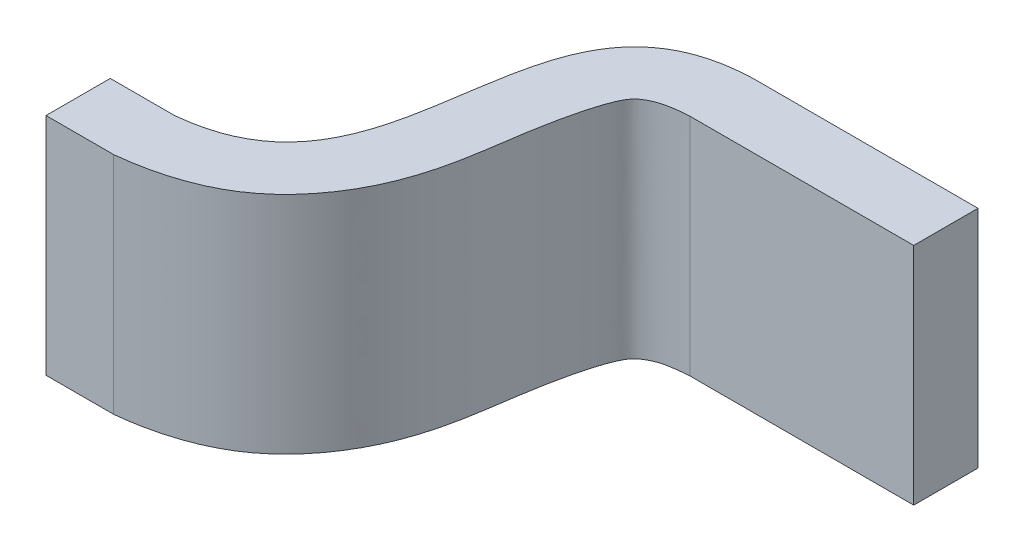
ISO-10303-21;
HEADER;
FILE_DESCRIPTION(('STEP AP214'),'2;1');
FILE_NAME('part.step','',(''),(''),'','','');
FILE_SCHEMA(('AUTOMOTIVE_DESIGN { 1 0 10303 214 1 1 1 1 }'));
ENDSEC;
DATA;
#1=APPLICATION_CONTEXT('core data for automotive mechanical design processes');
#2=APPLICATION_PROTOCOL_DEFINITION('international standard','automotive_design',2000,#1);
#3=PRODUCT_CONTEXT('',#1,'mechanical');
#4=PRODUCT('Part','Part','',(#3));
#5=PRODUCT_RELATED_PRODUCT_CATEGORY('part','',(#4));
#6=PRODUCT_DEFINITION_FORMATION('','',#4);
#7=PRODUCT_DEFINITION_CONTEXT('part definition',#1,'design');
#8=PRODUCT_DEFINITION('design','',#6,#7);
#9=PRODUCT_DEFINITION_SHAPE('','',#8);
#10=(LENGTH_UNIT() NAMED_UNIT(*) SI_UNIT(.MILLI.,.METRE.));
#11=(NAMED_UNIT(*) PLANE_ANGLE_UNIT() SI_UNIT($,.RADIAN.));
#12=(NAMED_UNIT(*) SI_UNIT($,.STERADIAN.) SOLID_ANGLE_UNIT());
#13=UNCERTAINTY_MEASURE_WITH_UNIT(LENGTH_MEASURE(1.E-05),#10,'distance_accuracy_value','');
#14=(GEOMETRIC_REPRESENTATION_CONTEXT(3) GLOBAL_UNCERTAINTY_ASSIGNED_CONTEXT((#13)) GLOBAL_UNIT_ASSIGNED_CONTEXT((#10,
#11,#12)) REPRESENTATION_CONTEXT('',''));
#15=CARTESIAN_POINT('',(0.,0.,0.));
#16=DIRECTION('',(0.,0.,1.));
#17=DIRECTION('',(1.,0.,0.));
#18=AXIS2_PLACEMENT_3D('',#15,#16,#17);
#19=CARTESIAN_POINT('',(0.381062000989914,2.52312396585783,1.20000011583518));
#20=DIRECTION('',(0.,1.,4.37113882867379E-08));
#21=DIRECTION('',(-1.,0.,0.));
#22=AXIS2_PLACEMENT_3D('',#19,#20,#21);
#23=PLANE('',#22);
#24=DIRECTION('',(1.,0.,0.));
#25=VECTOR('',#24,1.);
#26=CARTESIAN_POINT('',(8.21956578272591,2.52312400956922,0.200000115835179));
#27=LINE('',#26,#25);
#28=CARTESIAN_POINT('',(8.21956578272591,2.52312400956922,0.200000115835179));
#29=VERTEX_POINT('',#28);
#30=CARTESIAN_POINT('',(8.91606200098991,2.52312400956922,0.200000115835179));
#31=VERTEX_POINT('',#30);
#32=EDGE_CURVE('E11',#29,#31,#27,.T.);
#33=ORIENTED_EDGE('',*,*,#32,.F.);
#34=CARTESIAN_POINT('',(8.21956578272591,2.52312400956922,0.200000115835179));
#35=CARTESIAN_POINT('',(8.21399807265752,2.52312400955949,0.200222776944905));
#36=CARTESIAN_POINT('',(8.20843683975348,2.52312400954419,0.200572641902588));
#37=CARTESIAN_POINT('',(8.19732835868844,2.52312400950362,0.201500774403512));
#38=CARTESIAN_POINT('',(8.19178112714533,2.52312400947834,0.202079242715004));
#39=CARTESIAN_POINT('',(8.18066889231238,2.52312400941871,0.203443322434662));
#40=CARTESIAN_POINT('',(8.17510408096633,2.5231240093843,0.204230494227507));
#41=CARTESIAN_POINT('',(8.16401243640824,2.52312400930556,0.206032025455519));
#42=CARTESIAN_POINT('',(8.15848559635561,2.52312400926123,0.207046342801843));
#43=CARTESIAN_POINT('',(8.1465743503038,2.5231240091484,0.209627439938685));
#44=CARTESIAN_POINT('',(8.14020246940725,2.52312400907708,0.211258532996007));
#45=CARTESIAN_POINT('',(8.12921644404484,2.52312400891854,0.214886282236412));
#46=CARTESIAN_POINT('',(8.12454576276441,2.52312400883918,0.216702760571251));
#47=CARTESIAN_POINT('',(8.11575076349414,2.52312400866246,0.220743140574118));
#48=CARTESIAN_POINT('',(8.11161057174428,2.52312400856656,0.222934029282875));
#49=CARTESIAN_POINT('',(8.10253183379761,2.52312400834097,0.228105288870864));
#50=CARTESIAN_POINT('',(8.09762635625911,2.52312400820857,0.231151795559119));
#51=CARTESIAN_POINT('',(8.09022405842899,2.52312400795017,0.237031494419057));
#52=CARTESIAN_POINT('',(8.08749164440591,2.52312400783869,0.239554186113194));
#53=CARTESIAN_POINT('',(8.08246087272025,2.52312400760365,0.245002831356049));
#54=CARTESIAN_POINT('',(8.08016330387861,2.52312400748007,0.247929501418368));
#55=CARTESIAN_POINT('',(8.0759951087917,2.52312400721485,0.253960636256993));
#56=CARTESIAN_POINT('',(8.07411551519148,2.52312400707371,0.25705910373885));
#57=CARTESIAN_POINT('',(8.0706064493533,2.52312400679961,0.263392983262515));
#58=CARTESIAN_POINT('',(8.06897710136162,2.52312400666664,0.266628462319741));
#59=CARTESIAN_POINT('',(8.06367328775614,2.52312400620033,0.277849961425244));
#60=CARTESIAN_POINT('',(8.06040085858409,2.52312400585197,0.286022147622745));
#61=CARTESIAN_POINT('',(8.05218527798451,2.52312400487333,0.308422259036946));
#62=CARTESIAN_POINT('',(8.04771455008864,2.52312400421915,0.322813352311754));
#63=CARTESIAN_POINT('',(8.03961753260656,2.52312400294465,0.351470017552813));
#64=CARTESIAN_POINT('',(8.03597437543715,2.5231240023239,0.365731021163681));
#65=CARTESIAN_POINT('',(8.02919339350917,2.52312400107437,0.394362236027059));
#66=CARTESIAN_POINT('',(8.02605527280588,2.52312400044561,0.408732378117502));
#67=CARTESIAN_POINT('',(8.01736410075411,2.52312399859094,0.451139639563148));
#68=CARTESIAN_POINT('',(8.01232518312452,2.52312399736121,0.47928285266773));
#69=CARTESIAN_POINT('',(8.00335647907099,2.52312399489062,0.535811291131599));
#70=CARTESIAN_POINT('',(7.99942969347175,2.52312399364972,0.564196962317594));
#71=CARTESIAN_POINT('',(7.99170167000416,2.52312399139707,0.615729883457315));
#72=CARTESIAN_POINT('',(7.98800715437185,2.52312399038463,0.638892226484105));
#73=CARTESIAN_POINT('',(7.9794355355205,2.52312398836895,0.685005925928551));
#74=CARTESIAN_POINT('',(7.97455858675596,2.52312398736571,0.707957309496564));
#75=CARTESIAN_POINT('',(7.96311271686074,2.52312398538232,0.753331714529177));
#76=CARTESIAN_POINT('',(7.95655194608926,2.52312398440209,0.775756728489748));
#77=CARTESIAN_POINT('',(7.94136784202336,2.52312398247281,0.819893767638995));
#78=CARTESIAN_POINT('',(7.93274558328642,2.52312398152374,0.841606157601739));
#79=CARTESIAN_POINT('',(7.91043792110496,2.52312397940145,0.89015849210333));
#80=CARTESIAN_POINT('',(7.89600936729224,2.5231239782429,0.916662758440508));
#81=CARTESIAN_POINT('',(7.86347434987592,2.52312397602451,0.967413518681063));
#82=CARTESIAN_POINT('',(7.8453597746674,2.5231239749649,0.991654858034514));
#83=CARTESIAN_POINT('',(7.80790002602411,2.52312397310642,1.03417172187135));
#84=CARTESIAN_POINT('',(7.78897432705133,2.52312397229153,1.05281426512947));
#85=CARTESIAN_POINT('',(7.74844565833539,2.52312397080478,1.0868270722472));
#86=CARTESIAN_POINT('',(7.72685155874366,2.52312397013248,1.10220773934811));
#87=CARTESIAN_POINT('',(7.68359472899701,2.52312396901348,1.12780737627416));
#88=CARTESIAN_POINT('',(7.66213857495581,2.5231239685513,1.13838063101694));
#89=CARTESIAN_POINT('',(7.61806563506122,2.5231239677407,1.15692500960786));
#90=CARTESIAN_POINT('',(7.59544469766516,2.52312396739273,1.16488595544565));
#91=CARTESIAN_POINT('',(7.54848495398505,2.52312396678386,1.17881519350099));
#92=CARTESIAN_POINT('',(7.52411482818412,2.52312396652766,1.18467623918143));
#93=CARTESIAN_POINT('',(7.47514110847119,2.52312396611884,1.19402877138319));
#94=CARTESIAN_POINT('',(7.45054141254349,2.52312396596534,1.19754050603348));
#95=CARTESIAN_POINT('',(7.42586117783791,2.52312396585784,1.20000011583518));
#96=B_SPLINE_CURVE_WITH_KNOTS('',3,(#34,#35,#36,#37,#38,#39,#40,#41,#42,#43,#44,#45,#46,#47,#48,
#49,#50,#51,#52,#53,#54,#55,#56,#57,#58,#59,#60,#61,#62,#63,#64,#65,#66,#67,#68,#69,#70,#71,#72,
#73,#74,#75,#76,#77,#78,#79,#80,#81,#82,#83,#84,#85,#86,#87,#88,#89,#90,#91,#92,#93,#94,#95),
.UNSPECIFIED.,.F.,.F.,(4,2,2,2,2,2,2,2,2,2,2,2,2,2,2,2,2,2,2,2,2,2,2,2,2,2,2,2,2,2,4),(0.,
0.0167129049826591,0.0334405206169283,0.0502969119078462,0.0671501823813333,0.0868449977925691,
0.101838970321101,0.115885127156847,0.133132127804882,0.144236213112223,0.155360252414285,
0.166215762863006,0.177076645740437,0.203446553112075,0.248618617741089,0.29276509657911,
0.336885611219411,0.422622380023035,0.50858833183353,0.578941414817065,0.649285312924711,
0.719294937731856,0.789268149044618,0.87950221806083,0.969937050040229,1.04934324822106,
1.12849225200604,1.200024637838,1.27183250557101,1.34691026454656,1.42133231106535),.UNSPECIFIED.);
#97=CARTESIAN_POINT('',(7.42586117783791,2.52312396585783,1.20000011583518));
#98=VERTEX_POINT('',#97);
#99=EDGE_CURVE('E144',#29,#98,#96,.T.);
#100=ORIENTED_EDGE('',*,*,#99,.T.);
#101=DIRECTION('',(1.,0.,0.));
#102=VECTOR('',#101,1.);
#103=CARTESIAN_POINT('',(7.21606200098991,2.52312396585783,1.20000011583518));
#104=LINE('',#103,#102);
#105=CARTESIAN_POINT('',(7.21606200098991,2.52312396585783,1.20000011583518));
#106=VERTEX_POINT('',#105);
#107=EDGE_CURVE('E153',#106,#98,#104,.T.);
#108=ORIENTED_EDGE('',*,*,#107,.F.);
#109=DIRECTION('',(0.,4.37113878426487E-08,-0.999999999999999));
#110=VECTOR('',#109,1.);
#111=CARTESIAN_POINT('',(7.21606200098991,2.52312396585783,1.20000011583518));
#112=LINE('',#111,#110);
#113=CARTESIAN_POINT('',(7.21606200098991,2.52312397460011,1.00000011583518));
#114=VERTEX_POINT('',#113);
#115=EDGE_CURVE('E176',#106,#114,#112,.T.);
#116=ORIENTED_EDGE('',*,*,#115,.T.);
#117=DIRECTION('',(-1.,0.,0.));
#118=VECTOR('',#117,1.);
#119=CARTESIAN_POINT('',(7.41606200098991,2.52312397460011,1.00000011583518));
#120=LINE('',#119,#118);
#121=CARTESIAN_POINT('',(7.41606200098991,2.52312397460011,1.00000011583518));
#122=VERTEX_POINT('',#121);
#123=EDGE_CURVE('E166',#122,#114,#120,.T.);
#124=ORIENTED_EDGE('',*,*,#123,.F.);
#125=CARTESIAN_POINT('',(8.21606200098991,2.5231240183115,1.15835178985639E-07));
#126=CARTESIAN_POINT('',(8.19358510313693,2.52312401827862,0.000752060468581158));
#127=CARTESIAN_POINT('',(8.17100793476501,2.52312401820095,0.00252901377854064));
#128=CARTESIAN_POINT('',(8.12597309478915,2.5231240179187,0.00898640023387658));
#129=CARTESIAN_POINT('',(8.10352138339691,2.52312401771237,0.0137066074111825));
#130=CARTESIAN_POINT('',(8.06515365819845,2.52312401720618,0.0252870083113087));
#131=CARTESIAN_POINT('',(8.04899929251523,2.52312401694226,0.0313245870723057));
#132=CARTESIAN_POINT('',(8.01789140683102,2.52312401630879,0.0458166204881442));
#133=CARTESIAN_POINT('',(8.00293202850773,2.5231240159398,0.0542582222089987));
#134=CARTESIAN_POINT('',(7.97580927414815,2.52312401512717,0.0728490012215347));
#135=CARTESIAN_POINT('',(7.96351851659414,2.52312401469169,0.0828115771405194));
#136=CARTESIAN_POINT('',(7.94069381725784,2.52312401373943,0.104596721389228));
#137=CARTESIAN_POINT('',(7.93016206041085,2.52312401322255,0.116421568042133));
#138=CARTESIAN_POINT('',(7.90934268339576,2.52312401203432,0.143605165307551));
#139=CARTESIAN_POINT('',(7.89939730340264,2.52312401135162,0.159223393880874));
#140=CARTESIAN_POINT('',(7.8817786902267,2.52312400993181,0.191705024628724));
#141=CARTESIAN_POINT('',(7.87411125124448,2.52312400919456,0.208571468087363));
#142=CARTESIAN_POINT('',(7.85831224281672,2.52312400743597,0.248803432527052));
#143=CARTESIAN_POINT('',(7.85089650929936,2.52312400640268,0.272442120704842));
#144=CARTESIAN_POINT('',(7.83819654268846,2.52312400431375,0.320231127397665));
#145=CARTESIAN_POINT('',(7.83291120075709,2.52312400325813,0.34438117285117));
#146=CARTESIAN_POINT('',(7.82019523572656,2.52312400038412,0.410131041851886));
#147=CARTESIAN_POINT('',(7.81390954748546,2.52312399855682,0.451934402083061));
#148=CARTESIAN_POINT('',(7.80123041061269,2.52312399489243,0.535765928705813));
#149=CARTESIAN_POINT('',(7.79483655698354,2.52312399305533,0.57779405169264));
#150=CARTESIAN_POINT('',(7.78272745030488,2.52312399036376,0.639369848598376));
#151=CARTESIAN_POINT('',(7.77840818033405,2.52312398949819,0.659171782886779));
#152=CARTESIAN_POINT('',(7.76846333575577,2.52312398778033,0.698471838212411));
#153=CARTESIAN_POINT('',(7.76283677771603,2.52312398692805,0.717969718676909));
#154=CARTESIAN_POINT('',(7.74980357127116,2.5231239852589,0.756155364665872));
#155=CARTESIAN_POINT('',(7.74241624835149,2.52312398444175,0.774849489753706));
#156=CARTESIAN_POINT('',(7.72528765923403,2.52312398285693,0.81110604819965));
#157=CARTESIAN_POINT('',(7.71555219177743,2.52312398208914,0.828671136436786));
#158=CARTESIAN_POINT('',(7.69291712212291,2.5231239806087,0.862539616126325));
#159=CARTESIAN_POINT('',(7.67992280719315,2.52312397989875,0.878781377405067));
#160=CARTESIAN_POINT('',(7.6509915949129,2.52312397860445,0.908391476138882));
#161=CARTESIAN_POINT('',(7.63505740825526,2.52312397801999,0.921762436225387));
#162=CARTESIAN_POINT('',(7.60251216289671,2.52312397704608,0.944042929275912));
#163=CARTESIAN_POINT('',(7.58610329850445,2.52312397664351,0.953252501908174));
#164=CARTESIAN_POINT('',(7.55200247896581,2.52312397595383,0.969030528465972));
#165=CARTESIAN_POINT('',(7.53430550805647,2.52312397566721,0.975587925812751));
#166=CARTESIAN_POINT('',(7.49987529020758,2.52312397521736,0.985879214749981));
#167=CARTESIAN_POINT('',(7.48319962545166,2.52312397504532,0.989814821998697));
#168=CARTESIAN_POINT('',(7.44971156339336,2.52312397477337,0.996036316685443));
#169=CARTESIAN_POINT('',(7.43290223265527,2.52312397467274,0.998338413303283));
#170=CARTESIAN_POINT('',(7.41606200098991,2.52312397460011,1.00000011583518));
#171=B_SPLINE_CURVE_WITH_KNOTS('',3,(#125,#126,#127,#128,#129,#130,#131,#132,#133,#134,#135,
#136,#137,#138,#139,#140,#141,#142,#143,#144,#145,#146,#147,#148,#149,#150,#151,#152,#153,#154,
#155,#156,#157,#158,#159,#160,#161,#162,#163,#164,#165,#166,#167,#168,#169,#170),.UNSPECIFIED.,
.F.,.F.,(4,2,2,2,2,2,2,2,2,2,2,2,2,2,2,2,2,2,2,2,2,2,4),(0.,0.0676605368254322,
0.136255841823736,0.187815232472042,0.239103979458815,0.286357475935161,0.333669238509404,
0.388978971846571,0.44442821035716,0.518581097757562,0.592695339665635,0.719482422739692,
0.846974988060579,0.907746805484855,0.968564488536605,1.02874313069962,1.08877465652057,
1.15080863583323,1.21278570033354,1.2689745883637,1.32539536427915,1.3767136749948,
1.42751535438906),.UNSPECIFIED.);
#172=CARTESIAN_POINT('',(8.21606200098991,2.5231240183115,1.15835178959856E-07));
#173=VERTEX_POINT('',#172);
#174=EDGE_CURVE('E99',#173,#122,#171,.T.);
#175=ORIENTED_EDGE('',*,*,#174,.F.);
#176=DIRECTION('',(1.,0.,0.));
#177=VECTOR('',#176,1.);
#178=CARTESIAN_POINT('',(8.21606200098991,2.5231240183115,1.15835178959856E-07));
#179=LINE('',#178,#177);
#180=CARTESIAN_POINT('',(8.91606200098991,2.5231240183115,1.15835178959856E-07));
#181=VERTEX_POINT('',#180);
#182=EDGE_CURVE('E93',#173,#181,#179,.T.);
#183=ORIENTED_EDGE('',*,*,#182,.T.);
#184=DIRECTION('',(0.,4.37113878426487E-08,-0.999999999999999));
#185=VECTOR('',#184,1.);
#186=CARTESIAN_POINT('',(8.91606200098991,2.52312400956922,0.200000115835179));
#187=LINE('',#186,#185);
#188=EDGE_CURVE('E145',#31,#181,#187,.T.);
#189=ORIENTED_EDGE('',*,*,#188,.F.);
#190=EDGE_LOOP('',(#33,#100,#108,#116,#124,#175,#183,#189));
#191=FACE_BOUND('',#190,.T.);
#192=ADVANCED_FACE('F17',(#191),#23,.F.);
#193=CARTESIAN_POINT('',(8.91606200098991,-0.126876034142165,1.2));
#194=DIRECTION('',(-1.,0.,0.));
#195=DIRECTION('',(0.,-1.,-4.37113882867379E-08));
#196=AXIS2_PLACEMENT_3D('',#193,#194,#195);
#197=PLANE('',#196);
#198=DIRECTION('',(0.,-0.999999999999999,-4.37113883184585E-08));
#199=VECTOR('',#198,1.);
#200=CARTESIAN_POINT('',(8.91606200098991,3.22312400956922,0.200000146433151));
#201=LINE('',#200,#199);
#202=CARTESIAN_POINT('',(8.91606200098991,3.22312400956922,0.200000146433151));
#203=VERTEX_POINT('',#202);
#204=EDGE_CURVE('E25',#203,#31,#201,.T.);
#205=ORIENTED_EDGE('',*,*,#204,.T.);
#206=ORIENTED_EDGE('',*,*,#188,.T.);
#207=DIRECTION('',(0.,0.999999999999999,4.37113882867379E-08));
#208=VECTOR('',#207,1.);
#209=CARTESIAN_POINT('',(8.91606200098992,2.5231240183115,1.15835178959856E-07));
#210=LINE('',#209,#208);
#211=CARTESIAN_POINT('',(8.91606200098991,3.2231240183115,1.46433150760572E-07));
#212=VERTEX_POINT('',#211);
#213=EDGE_CURVE('E178',#181,#212,#210,.T.);
#214=ORIENTED_EDGE('',*,*,#213,.T.);
#215=DIRECTION('',(0.,4.37113856222026E-08,-0.999999999999999));
#216=VECTOR('',#215,1.);
#217=CARTESIAN_POINT('',(8.91606200098991,3.22312400956922,0.200000146433151));
#218=LINE('',#217,#216);
#219=EDGE_CURVE('E168',#203,#212,#218,.T.);
#220=ORIENTED_EDGE('',*,*,#219,.F.);
#221=EDGE_LOOP('',(#205,#206,#214,#220));
#222=FACE_BOUND('',#221,.T.);
#223=ADVANCED_FACE('F129',(#222),#197,.F.);
#224=CARTESIAN_POINT('',(0.381062000989914,3.22312396585783,1.20000014643315));
#225=DIRECTION('',(0.,1.,4.37113882867379E-08));
#226=DIRECTION('',(-1.,0.,0.));
#227=AXIS2_PLACEMENT_3D('',#224,#225,#226);
#228=PLANE('',#227);
#229=CARTESIAN_POINT('',(7.42586117783791,3.22312396585783,1.20000014643315));
#230=CARTESIAN_POINT('',(7.44449456455245,3.22312396593834,1.19815829311156));
#231=CARTESIAN_POINT('',(7.46307138920936,3.22312396604573,1.1957015166836));
#232=CARTESIAN_POINT('',(7.50004861252762,3.22312396631693,1.18949711709641));
#233=CARTESIAN_POINT('',(7.51844854392413,3.22312396648087,1.18574671960165));
#234=CARTESIAN_POINT('',(7.55509153595032,3.22312396686924,1.1768617432686));
#235=CARTESIAN_POINT('',(7.57333169379044,3.22312396709421,1.17171500907457));
#236=CARTESIAN_POINT('',(7.60930812319983,3.22312396760934,1.15993021636413));
#237=CARTESIAN_POINT('',(7.62704477874541,3.22312396789945,1.15329333065393));
#238=CARTESIAN_POINT('',(7.66763102639651,3.22312396866299,1.13582561747603));
#239=CARTESIAN_POINT('',(7.69020930230345,3.22312396916528,1.12433441236623));
#240=CARTESIAN_POINT('',(7.73310469641282,3.22312397032142,1.09788519223995));
#241=CARTESIAN_POINT('',(7.75343190343484,3.22312397097454,1.08294365553175));
#242=CARTESIAN_POINT('',(7.79009677821303,3.22312397234773,1.05152865848007));
#243=CARTESIAN_POINT('',(7.80662324596257,3.22312397305833,1.0352719624628));
#244=CARTESIAN_POINT('',(7.83755765996604,3.22312397456551,1.00079164379411));
#245=CARTESIAN_POINT('',(7.85196002142665,3.22312397536231,0.98256304699255));
#246=CARTESIAN_POINT('',(7.88022177077408,3.22312397712182,0.942310265469555));
#247=CARTESIAN_POINT('',(7.89380605024984,3.22312397809294,0.920093478990381));
#248=CARTESIAN_POINT('',(7.91819190207816,3.22312398009773,0.874229263846631));
#249=CARTESIAN_POINT('',(7.92899719645396,3.22312398113131,0.850583801679557));
#250=CARTESIAN_POINT('',(7.94870311897535,3.2231239833315,0.800249273213149));
#251=CARTESIAN_POINT('',(7.95737164040108,3.22312398450204,0.773470381934672));
#252=CARTESIAN_POINT('',(7.97209186166946,3.2231239868744,0.719197126059222));
#253=CARTESIAN_POINT('',(7.97814037844916,3.22312398807626,0.691701933955639));
#254=CARTESIAN_POINT('',(7.98658106878577,3.22312399004254,0.646718729204653));
#255=CARTESIAN_POINT('',(7.9894956830336,3.22312399080298,0.62932158999021));
#256=CARTESIAN_POINT('',(7.99494513059396,3.2231239923266,0.59446518172622));
#257=CARTESIAN_POINT('',(7.99747987765393,3.22312399308977,0.577005899485013));
#258=CARTESIAN_POINT('',(8.0025677923373,3.22312399461587,0.542092952289064));
#259=CARTESIAN_POINT('',(8.0051209563143,3.22312399537879,0.524639286900343));
#260=CARTESIAN_POINT('',(8.01066424363703,3.22312399690142,0.489805741266521));
#261=CARTESIAN_POINT('',(8.01365424883576,3.22312399766112,0.472425842374471));
#262=CARTESIAN_POINT('',(8.02152943419566,3.22312399951487,0.430017032898861));
#263=CARTESIAN_POINT('',(8.02666524973689,3.22312400060698,0.405032304682354));
#264=CARTESIAN_POINT('',(8.03548182293312,3.22312400223388,0.36781302785188));
#265=CARTESIAN_POINT('',(8.03860689712085,3.22312400277441,0.355447107207849));
#266=CARTESIAN_POINT('',(8.04536938827822,3.22312400384923,0.330858216277031));
#267=CARTESIAN_POINT('',(8.0490065173587,3.22312400438353,0.318635169816701));
#268=CARTESIAN_POINT('',(8.05548047715351,3.22312400522547,0.29937351408224));
#269=CARTESIAN_POINT('',(8.05804302673184,3.22312400553709,0.292244100310987));
#270=CARTESIAN_POINT('',(8.0636211387904,3.22312400615223,0.278172012219551));
#271=CARTESIAN_POINT('',(8.06663601514539,3.22312400645575,0.271229073529859));
#272=CARTESIAN_POINT('',(8.07290394389426,3.22312400699022,0.25900006127776));
#273=CARTESIAN_POINT('',(8.07601005444361,3.22312400722422,0.25364488459391));
#274=CARTESIAN_POINT('',(8.08294021652617,3.22312400763222,0.244316143597421));
#275=CARTESIAN_POINT('',(8.08663640359496,3.22312400781004,0.240254122817685));
#276=CARTESIAN_POINT('',(8.09608537337927,3.22312400816656,0.232076112648614));
#277=CARTESIAN_POINT('',(8.10212282018808,3.22312400832975,0.228304198420808));
#278=CARTESIAN_POINT('',(8.1113394806663,3.22312400855853,0.223113238150879));
#279=CARTESIAN_POINT('',(8.11442600625127,3.22312400863187,0.221466306758503));
#280=CARTESIAN_POINT('',(8.12071629067352,3.22312400876321,0.218417518195715));
#281=CARTESIAN_POINT('',(8.12391972716149,3.22312400882125,0.217015040865018));
#282=CARTESIAN_POINT('',(8.13303992233348,3.22312400897159,0.213465188849452));
#283=CARTESIAN_POINT('',(8.13907333321131,3.22312400905404,0.211621845714587));
#284=CARTESIAN_POINT('',(8.14884209661085,3.22312400916708,0.20913735378251));
#285=CARTESIAN_POINT('',(8.15253527613093,3.22312400920524,0.208309839512022));
#286=CARTESIAN_POINT('',(8.15995085696976,3.22312400927275,0.206799804590628));
#287=CARTESIAN_POINT('',(8.16367325397941,3.2231240093021,0.206117262960337));
#288=CARTESIAN_POINT('',(8.17603608060719,3.22312400939235,0.204032222659835));
#289=CARTESIAN_POINT('',(8.18471588454658,3.22312400944403,0.202861256763462));
#290=CARTESIAN_POINT('',(8.19776684921997,3.22312400950474,0.201476741708385));
#291=CARTESIAN_POINT('',(8.20211947594062,3.22312400952216,0.201077367887049));
#292=CARTESIAN_POINT('',(8.21083512156969,3.22312400955065,0.200424137179815));
#293=CARTESIAN_POINT('',(8.2151981395132,3.22312400956172,0.200170267274331));
#294=CARTESIAN_POINT('',(8.21956578272591,3.22312400956922,0.200000146433151));
#295=B_SPLINE_CURVE_WITH_KNOTS('',3,(#229,#230,#231,#232,#233,#234,#235,#236,#237,#238,#239,
#240,#241,#242,#243,#244,#245,#246,#247,#248,#249,#250,#251,#252,#253,#254,#255,#256,#257,#258,
#259,#260,#261,#262,#263,#264,#265,#266,#267,#268,#269,#270,#271,#272,#273,#274,#275,#276,#277,
#278,#279,#280,#281,#282,#283,#284,#285,#286,#287,#288,#289,#290,#291,#292,#293,#294),
.UNSPECIFIED.,.F.,.F.,(4,2,2,2,2,2,2,2,2,2,2,2,2,2,2,2,2,2,2,2,2,2,2,2,2,2,2,2,2,2,2,2,4),(0.,
0.0561681589095705,0.112457534383138,0.16925357861237,0.226005077906886,0.301715004036544,
0.377070566346,0.446424912055152,0.515958475234817,0.593880428548584,0.671697467408244,
0.755964517163008,0.840333658382208,0.893247792631839,0.946173923407371,0.999089848164162,
1.05199148781442,1.12847716172405,1.16673541076623,1.20497223539784,1.22769072756634,
1.25037510056687,1.26886797593494,1.28517999290265,1.30634908955326,1.31685139211729,
1.32732665061524,1.34619861049414,1.35755137220421,1.36890248990409,1.39515927363249,
1.40827024085607,1.42138003473644),.UNSPECIFIED.);
#296=CARTESIAN_POINT('',(7.42586117783791,3.22312396585783,1.20000014643315));
#297=VERTEX_POINT('',#296);
#298=CARTESIAN_POINT('',(8.21956578272591,3.22312400956922,0.200000146433151));
#299=VERTEX_POINT('',#298);
#300=EDGE_CURVE('E137',#297,#299,#295,.T.);
#301=ORIENTED_EDGE('',*,*,#300,.T.);
#302=DIRECTION('',(-1.,0.,0.));
#303=VECTOR('',#302,1.);
#304=CARTESIAN_POINT('',(8.91606200098991,3.22312400956922,0.20000014643315));
#305=LINE('',#304,#303);
#306=EDGE_CURVE('E180',#203,#299,#305,.T.);
#307=ORIENTED_EDGE('',*,*,#306,.F.);
#308=ORIENTED_EDGE('',*,*,#219,.T.);
#309=DIRECTION('',(1.,0.,0.));
#310=VECTOR('',#309,1.);
#311=CARTESIAN_POINT('',(8.21606200098991,3.2231240183115,1.46433150760572E-07));
#312=LINE('',#311,#310);
#313=CARTESIAN_POINT('',(8.21606200098991,3.2231240183115,1.46433150760572E-07));
#314=VERTEX_POINT('',#313);
#315=EDGE_CURVE('E89',#314,#212,#312,.T.);
#316=ORIENTED_EDGE('',*,*,#315,.F.);
#317=CARTESIAN_POINT('',(7.41606200098991,3.22312397460011,1.00000014643315));
#318=CARTESIAN_POINT('',(7.43815778445574,3.22312397469533,0.997821656245103));
#319=CARTESIAN_POINT('',(7.46027008731141,3.22312397483942,0.994525285186105));
#320=CARTESIAN_POINT('',(7.50408400428581,3.22312397525691,0.984974292672355));
#321=CARTESIAN_POINT('',(7.52577839318445,3.22312397553172,0.978687426312377));
#322=CARTESIAN_POINT('',(7.56322329112044,3.22312397616423,0.964217354769986));
#323=CARTESIAN_POINT('',(7.5792399824135,3.22312397649087,0.956744450547586));
#324=CARTESIAN_POINT('',(7.60983504569206,3.22312397724919,0.939396203850117));
#325=CARTESIAN_POINT('',(7.62441982579596,3.22312397768036,0.929532321418256));
#326=CARTESIAN_POINT('',(7.65126115653245,3.22312397862777,0.907858113568546));
#327=CARTESIAN_POINT('',(7.6635794953477,3.22312397914066,0.896124373556234));
#328=CARTESIAN_POINT('',(7.68622733401037,3.22312398024537,0.870851495061245));
#329=CARTESIAN_POINT('',(7.69655342153458,3.22312398083732,0.857309325052825));
#330=CARTESIAN_POINT('',(7.72884756758449,3.22312398298411,0.808196686858197));
#331=CARTESIAN_POINT('',(7.74576979626087,3.22312398468164,0.769361701724757));
#332=CARTESIAN_POINT('',(7.76850315318357,3.22312398771057,0.700067913553522));
#333=CARTESIAN_POINT('',(7.77605677562103,3.22312398902294,0.670044164635463));
#334=CARTESIAN_POINT('',(7.78893462477029,3.22312399167122,0.609458584143951));
#335=CARTESIAN_POINT('',(7.79425506876476,3.22312399300716,0.578895930227287));
#336=CARTESIAN_POINT('',(7.80736012985758,3.223123996586,0.497021644491724));
#337=CARTESIAN_POINT('',(7.81438963042532,3.2231239988335,0.445604821645049));
#338=CARTESIAN_POINT('',(7.82796229628551,3.22312400218308,0.368975338703381));
#339=CARTESIAN_POINT('',(7.83298877156952,3.22312400329557,0.343524372231839));
#340=CARTESIAN_POINT('',(7.84502531219308,3.2231240054988,0.293120494476764));
#341=CARTESIAN_POINT('',(7.85203211919115,3.22312400658957,0.268166836549349));
#342=CARTESIAN_POINT('',(7.8696664235696,3.22312400877064,0.218269786618546));
#343=CARTESIAN_POINT('',(7.88043363403057,3.223124009859,0.193370846879312));
#344=CARTESIAN_POINT('',(7.90026910052031,3.22312401139717,0.158181406897513));
#345=CARTESIAN_POINT('',(7.90746633375543,3.22312401189274,0.146844113194546));
#346=CARTESIAN_POINT('',(7.92318388320907,3.22312401284169,0.125134699088058));
#347=CARTESIAN_POINT('',(7.93170293407124,3.22312401329511,0.114761670638015));
#348=CARTESIAN_POINT('',(7.95303839952588,3.22312401428579,0.0920977534487856));
#349=CARTESIAN_POINT('',(7.96635443397192,3.22312401480287,0.0802681917571193));
#350=CARTESIAN_POINT('',(7.99492929472639,3.22312401572307,0.0592163752155682));
#351=CARTESIAN_POINT('',(8.01019136911424,3.223124016126,0.0499985643969283));
#352=CARTESIAN_POINT('',(8.04268080697371,3.22312401683092,0.0338719816870521));
#353=CARTESIAN_POINT('',(8.05996419457089,3.22312401712787,0.0270783020968767));
#354=CARTESIAN_POINT('',(8.09533290547705,3.22312401761224,0.0159972198193967));
#355=CARTESIAN_POINT('',(8.11342000632037,3.22312401779939,0.011715703680814));
#356=CARTESIAN_POINT('',(8.14565822903883,3.22312401805052,0.00597065826712747));
#357=CARTESIAN_POINT('',(8.15973896311656,3.22312401813307,0.00408197404208984));
#358=CARTESIAN_POINT('',(8.18790024228703,3.22312401825332,0.00133098364696402));
#359=CARTESIAN_POINT('',(8.20198005813918,3.22312401829134,0.000461382229156337));
#360=CARTESIAN_POINT('',(8.21606200098995,3.2231240183115,1.46433149535788E-07));
#361=B_SPLINE_CURVE_WITH_KNOTS('',3,(#317,#318,#319,#320,#321,#322,#323,#324,#325,#326,#327,
#328,#329,#330,#331,#332,#333,#334,#335,#336,#337,#338,#339,#340,#341,#342,#343,#344,#345,#346,
#347,#348,#349,#350,#351,#352,#353,#354,#355,#356,#357,#358,#359,#360),.UNSPECIFIED.,.F.,.F.,(4,
2,2,2,2,2,2,2,2,2,2,2,2,2,2,2,2,2,2,2,2,4),(0.,0.0667821137090889,0.134301214684031,
0.187128508823993,0.239707439757742,0.290518731452934,0.34141629467506,0.466712259088976,
0.559563019654512,0.652570428897924,0.808245450373598,0.886023921415198,0.96367515719079,
1.04458784966541,1.08478909463837,1.12495209032638,1.17807587168458,1.2312895104201,
1.28677003517691,1.34238004906255,1.38496468867346,1.42724258099923),.UNSPECIFIED.);
#362=CARTESIAN_POINT('',(7.41606200098991,3.22312397460011,1.00000014643315));
#363=VERTEX_POINT('',#362);
#364=EDGE_CURVE('E81',#363,#314,#361,.T.);
#365=ORIENTED_EDGE('',*,*,#364,.F.);
#366=DIRECTION('',(1.,0.,0.));
#367=VECTOR('',#366,1.);
#368=CARTESIAN_POINT('',(7.21606200098991,3.22312397460011,1.00000014643315));
#369=LINE('',#368,#367);
#370=CARTESIAN_POINT('',(7.21606200098991,3.22312397460011,1.00000014643315));
#371=VERTEX_POINT('',#370);
#372=EDGE_CURVE('E86',#371,#363,#369,.T.);
#373=ORIENTED_EDGE('',*,*,#372,.F.);
#374=DIRECTION('',(0.,4.37113878426487E-08,-0.999999999999999));
#375=VECTOR('',#374,1.);
#376=CARTESIAN_POINT('',(7.21606200098991,3.22312396585783,1.20000014643315));
#377=LINE('',#376,#375);
#378=CARTESIAN_POINT('',(7.21606200098991,3.22312396585783,1.20000014643315));
#379=VERTEX_POINT('',#378);
#380=EDGE_CURVE('E164',#379,#371,#377,.T.);
#381=ORIENTED_EDGE('',*,*,#380,.F.);
#382=DIRECTION('',(1.,0.,0.));
#383=VECTOR('',#382,1.);
#384=CARTESIAN_POINT('',(7.21606200098991,3.22312396585783,1.20000014643315));
#385=LINE('',#384,#383);
#386=EDGE_CURVE('E190',#379,#297,#385,.T.);
#387=ORIENTED_EDGE('',*,*,#386,.T.);
#388=EDGE_LOOP('',(#301,#307,#308,#316,#365,#373,#381,#387));
#389=FACE_BOUND('',#388,.T.);
#390=ADVANCED_FACE('F83',(#389),#228,.T.);
#391=CARTESIAN_POINT('',(7.21606200098991,-0.126876034142165,1.2));
#392=DIRECTION('',(-1.,0.,0.));
#393=DIRECTION('',(0.,-1.,-4.37113882867379E-08));
#394=AXIS2_PLACEMENT_3D('',#391,#392,#393);
#395=PLANE('',#394);
#396=ORIENTED_EDGE('',*,*,#380,.T.);
#397=DIRECTION('',(0.,-0.999999999999999,-4.37113881598552E-08));
#398=VECTOR('',#397,1.);
#399=CARTESIAN_POINT('',(7.21606200098991,3.22312397460011,1.00000014643315));
#400=LINE('',#399,#398);
#401=EDGE_CURVE('E107',#371,#114,#400,.T.);
#402=ORIENTED_EDGE('',*,*,#401,.T.);
#403=ORIENTED_EDGE('',*,*,#115,.F.);
#404=DIRECTION('',(0.,0.999999999999999,4.37113878426487E-08));
#405=VECTOR('',#404,1.);
#406=CARTESIAN_POINT('',(7.21606200098991,2.52312396585783,1.20000011583518));
#407=LINE('',#406,#405);
#408=EDGE_CURVE('E92',#106,#379,#407,.T.);
#409=ORIENTED_EDGE('',*,*,#408,.T.);
#410=EDGE_LOOP('',(#396,#402,#403,#409));
#411=FACE_BOUND('',#410,.T.);
#412=ADVANCED_FACE('F128',(#411),#395,.T.);
#413=CARTESIAN_POINT('',(0.381062000989914,-0.126875981688499,0.));
#414=DIRECTION('',(0.,-4.37113882867379E-08,1.));
#415=DIRECTION('',(0.,-1.,-4.37113882867379E-08));
#416=AXIS2_PLACEMENT_3D('',#413,#414,#415);
#417=PLANE('',#416);
#418=DIRECTION('',(0.,-0.999999999999999,-4.37113882867379E-08));
#419=VECTOR('',#418,1.);
#420=CARTESIAN_POINT('',(8.21606200098991,3.2231240183115,1.46433150760572E-07));
#421=LINE('',#420,#419);
#422=EDGE_CURVE('E174',#314,#173,#421,.T.);
#423=ORIENTED_EDGE('',*,*,#422,.F.);
#424=ORIENTED_EDGE('',*,*,#315,.T.);
#425=ORIENTED_EDGE('',*,*,#213,.F.);
#426=ORIENTED_EDGE('',*,*,#182,.F.);
#427=EDGE_LOOP('',(#423,#424,#425,#426));
#428=FACE_BOUND('',#427,.T.);
#429=ADVANCED_FACE('F227',(#428),#417,.F.);
#430=CARTESIAN_POINT('',(0.381062000989914,-0.126876034142165,1.2));
#431=DIRECTION('',(0.,-4.37113882867379E-08,1.));
#432=DIRECTION('',(0.,-1.,-4.37113882867379E-08));
#433=AXIS2_PLACEMENT_3D('',#430,#431,#432);
#434=PLANE('',#433);
#435=DIRECTION('',(0.,-0.999999999999999,-4.37113887942684E-08));
#436=VECTOR('',#435,1.);
#437=CARTESIAN_POINT('',(7.42586117783791,3.22312396585784,1.20000014643315));
#438=LINE('',#437,#436);
#439=EDGE_CURVE('E161',#297,#98,#438,.T.);
#440=ORIENTED_EDGE('',*,*,#439,.F.);
#441=ORIENTED_EDGE('',*,*,#386,.F.);
#442=ORIENTED_EDGE('',*,*,#408,.F.);
#443=ORIENTED_EDGE('',*,*,#107,.T.);
#444=EDGE_LOOP('',(#440,#441,#442,#443));
#445=FACE_BOUND('',#444,.T.);
#446=ADVANCED_FACE('F160',(#445),#434,.T.);
#447=CARTESIAN_POINT('',(0.381062000989914,5.01775443609411,1.00000022487894));
#448=DIRECTION('',(0.,4.37113882867379E-08,-1.));
#449=DIRECTION('',(0.,1.,4.37113882867379E-08));
#450=AXIS2_PLACEMENT_3D('',#447,#448,#449);
#451=PLANE('',#450);
#452=ORIENTED_EDGE('',*,*,#123,.T.);
#453=ORIENTED_EDGE('',*,*,#401,.F.);
#454=ORIENTED_EDGE('',*,*,#372,.T.);
#455=DIRECTION('',(0.,-0.999999999999999,-4.37113881598552E-08));
#456=VECTOR('',#455,1.);
#457=CARTESIAN_POINT('',(7.41606200098991,3.22312397460011,1.00000014643315));
#458=LINE('',#457,#456);
#459=EDGE_CURVE('E97',#363,#122,#458,.T.);
#460=ORIENTED_EDGE('',*,*,#459,.T.);
#461=EDGE_LOOP('',(#452,#453,#454,#460));
#462=FACE_BOUND('',#461,.T.);
#463=ADVANCED_FACE('F105',(#462),#451,.T.);
#464=CARTESIAN_POINT('',(7.41606200098991,5.01775443609411,1.00000022487894));
#465=CARTESIAN_POINT('',(8.06137939913391,5.01775443886489,0.93661226287194));
#466=CARTESIAN_POINT('',(7.55196529161691,5.01775447886606,0.0214920441178097));
#467=CARTESIAN_POINT('',(8.21606200098991,5.0177544798055,2.24878939694144E-07));
#468=B_SPLINE_CURVE_WITH_KNOTS('',3,(#464,#465,#466,#467),.UNSPECIFIED.,.F.,.F.,(4,4),(0.,1.),.UNSPECIFIED.);
#469=DIRECTION('',(0.,-0.999999999999999,-4.37113882867379E-08));
#470=VECTOR('',#469,1.);
#471=SURFACE_OF_LINEAR_EXTRUSION('',#468,#470);
#472=ORIENTED_EDGE('',*,*,#174,.T.);
#473=ORIENTED_EDGE('',*,*,#459,.F.);
#474=ORIENTED_EDGE('',*,*,#364,.T.);
#475=ORIENTED_EDGE('',*,*,#422,.T.);
#476=EDGE_LOOP('',(#472,#473,#474,#475));
#477=FACE_BOUND('',#476,.T.);
#478=ADVANCED_FACE('F98',(#477),#471,.T.);
#479=CARTESIAN_POINT('',(0.381062000989914,5.01775447106322,0.20000022487894));
#480=DIRECTION('',(0.,-4.37113882867379E-08,1.));
#481=DIRECTION('',(-1.,0.,0.));
#482=AXIS2_PLACEMENT_3D('',#479,#480,#481);
#483=PLANE('',#482);
#484=ORIENTED_EDGE('',*,*,#32,.T.);
#485=ORIENTED_EDGE('',*,*,#204,.F.);
#486=ORIENTED_EDGE('',*,*,#306,.T.);
#487=DIRECTION('',(0.,-0.999999999999999,-4.37113883184585E-08));
#488=VECTOR('',#487,1.);
#489=CARTESIAN_POINT('',(8.21956578272591,3.22312400956922,0.200000146433151));
#490=LINE('',#489,#488);
#491=EDGE_CURVE('E102',#299,#29,#490,.T.);
#492=ORIENTED_EDGE('',*,*,#491,.T.);
#493=EDGE_LOOP('',(#484,#485,#486,#492));
#494=FACE_BOUND('',#493,.T.);
#495=ADVANCED_FACE('F134',(#494),#483,.T.);
#496=CARTESIAN_POINT('',(7.42586117783791,5.01775442735183,1.20000022487894));
#497=CARTESIAN_POINT('',(7.52323557934491,5.01775442776993,1.19043537372094));
#498=CARTESIAN_POINT('',(7.72758399467491,5.01775443018266,1.13523848292794));
#499=CARTESIAN_POINT('',(7.96817675723591,5.01775444236442,0.85655227210794));
#500=CARTESIAN_POINT('',(8.00047382700591,5.01775445822105,0.49379478761794));
#501=CARTESIAN_POINT('',(8.06032189164391,5.01775446848464,0.25899132482694));
#502=CARTESIAN_POINT('',(8.09817849874591,5.0177544697967,0.22897490490494));
#503=CARTESIAN_POINT('',(8.14111952633391,5.01775447070118,0.20828275194794));
#504=CARTESIAN_POINT('',(8.19602789838591,5.01775447102387,0.20090043049794));
#505=CARTESIAN_POINT('',(8.21956578272591,5.01775447106322,0.20000022487894));
#506=B_SPLINE_CURVE_WITH_KNOTS('',3,(#496,#497,#498,#499,#500,#501,#502,#503,#504,#505),
.UNSPECIFIED.,.F.,.F.,(4,1,1,1,1,1,1,4),(-0.005037439357121,0.120331553469,0.245700546295,
0.496438531947,0.747176517599,0.872545510425,0.935230006838,0.997914503251),.UNSPECIFIED.);
#507=DIRECTION('',(0.,-0.999999999999999,-4.37113882867379E-08));
#508=VECTOR('',#507,1.);
#509=SURFACE_OF_LINEAR_EXTRUSION('',#506,#508);
#510=ORIENTED_EDGE('',*,*,#491,.F.);
#511=ORIENTED_EDGE('',*,*,#300,.F.);
#512=ORIENTED_EDGE('',*,*,#439,.T.);
#513=ORIENTED_EDGE('',*,*,#99,.F.);
#514=EDGE_LOOP('',(#510,#511,#512,#513));
#515=FACE_BOUND('',#514,.T.);
#516=ADVANCED_FACE('F130',(#515),#509,.F.);
#517=CLOSED_SHELL('',(#192,#223,#390,#412,#429,#446,#463,#478,#495,#516));
#518=MANIFOLD_SOLID_BREP('B1',#517);
#519=ADVANCED_BREP_SHAPE_REPRESENTATION('',(#18,#518),#14);
#520=SHAPE_DEFINITION_REPRESENTATION(#9,#519);
ENDSEC;
END-ISO-10303-21;
